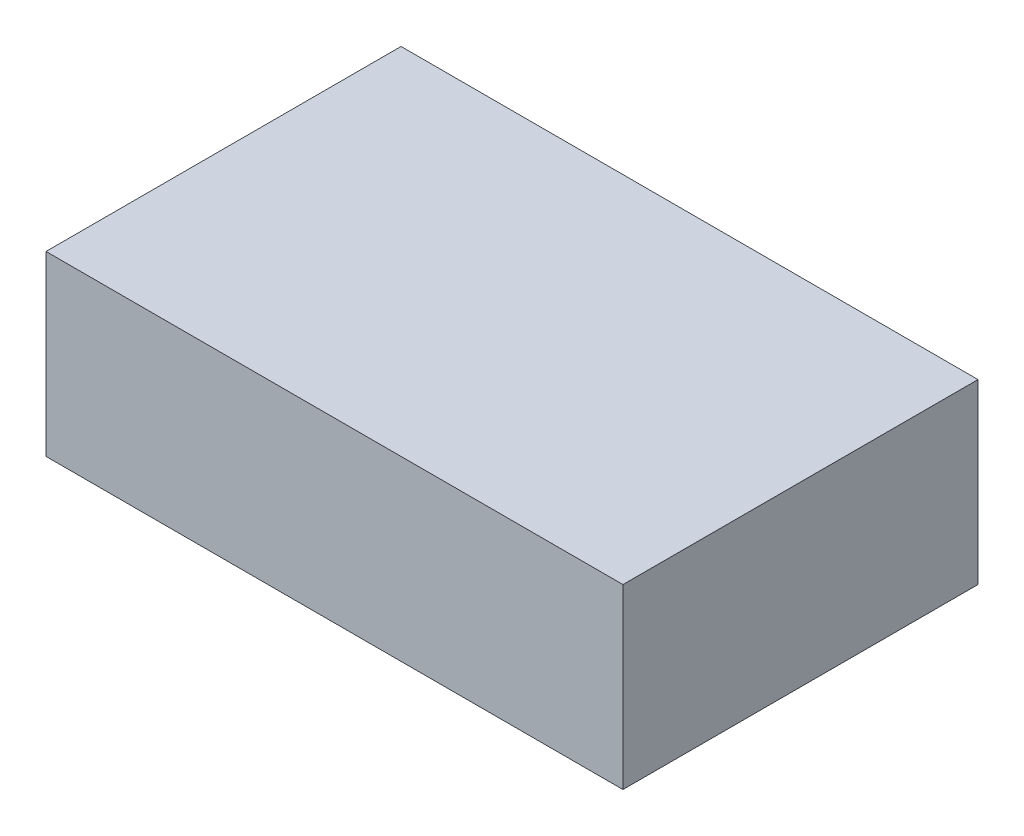
ISO-10303-21;
HEADER;
FILE_DESCRIPTION(('STEP AP214'),'2;1');
FILE_NAME('part.step','',(''),(''),'','','');
FILE_SCHEMA(('AUTOMOTIVE_DESIGN { 1 0 10303 214 1 1 1 1 }'));
ENDSEC;
DATA;
#1=APPLICATION_CONTEXT('core data for automotive mechanical design processes');
#2=APPLICATION_PROTOCOL_DEFINITION('international standard','automotive_design',2000,#1);
#3=PRODUCT_CONTEXT('',#1,'mechanical');
#4=PRODUCT('Part','Part','',(#3));
#5=PRODUCT_RELATED_PRODUCT_CATEGORY('part','',(#4));
#6=PRODUCT_DEFINITION_FORMATION('','',#4);
#7=PRODUCT_DEFINITION_CONTEXT('part definition',#1,'design');
#8=PRODUCT_DEFINITION('design','',#6,#7);
#9=PRODUCT_DEFINITION_SHAPE('','',#8);
#10=(LENGTH_UNIT() NAMED_UNIT(*) SI_UNIT(.MILLI.,.METRE.));
#11=(NAMED_UNIT(*) PLANE_ANGLE_UNIT() SI_UNIT($,.RADIAN.));
#12=(NAMED_UNIT(*) SI_UNIT($,.STERADIAN.) SOLID_ANGLE_UNIT());
#13=UNCERTAINTY_MEASURE_WITH_UNIT(LENGTH_MEASURE(1.E-05),#10,'distance_accuracy_value','');
#14=(GEOMETRIC_REPRESENTATION_CONTEXT(3) GLOBAL_UNCERTAINTY_ASSIGNED_CONTEXT((#13)) GLOBAL_UNIT_ASSIGNED_CONTEXT((#10,
#11,#12)) REPRESENTATION_CONTEXT('',''));
#15=CARTESIAN_POINT('',(0.,0.,0.));
#16=DIRECTION('',(0.,0.,1.));
#17=DIRECTION('',(1.,0.,0.));
#18=AXIS2_PLACEMENT_3D('',#15,#16,#17);
#19=CARTESIAN_POINT('',(65.,40.,40.));
#20=DIRECTION('',(-1.,0.,0.));
#21=DIRECTION('',(0.,0.,1.));
#22=AXIS2_PLACEMENT_3D('',#19,#20,#21);
#23=PLANE('',#22);
#24=DIRECTION('',(0.,0.,-1.));
#25=VECTOR('',#24,1.);
#26=CARTESIAN_POINT('',(65.,0.,40.));
#27=LINE('',#26,#25);
#28=CARTESIAN_POINT('',(65.,0.,40.));
#29=VERTEX_POINT('',#28);
#30=CARTESIAN_POINT('',(65.,0.,-40.));
#31=VERTEX_POINT('',#30);
#32=EDGE_CURVE('E96',#29,#31,#27,.T.);
#33=ORIENTED_EDGE('',*,*,#32,.T.);
#34=DIRECTION('',(0.,-1.,0.));
#35=VECTOR('',#34,1.);
#36=CARTESIAN_POINT('',(65.,40.,-40.));
#37=LINE('',#36,#35);
#38=CARTESIAN_POINT('',(65.,40.,-40.));
#39=VERTEX_POINT('',#38);
#40=EDGE_CURVE('E11',#39,#31,#37,.T.);
#41=ORIENTED_EDGE('',*,*,#40,.F.);
#42=DIRECTION('',(0.,0.,-1.));
#43=VECTOR('',#42,1.);
#44=CARTESIAN_POINT('',(65.,40.,40.));
#45=LINE('',#44,#43);
#46=CARTESIAN_POINT('',(65.,40.,40.));
#47=VERTEX_POINT('',#46);
#48=EDGE_CURVE('E84',#47,#39,#45,.T.);
#49=ORIENTED_EDGE('',*,*,#48,.F.);
#50=DIRECTION('',(0.,-1.,0.));
#51=VECTOR('',#50,1.);
#52=CARTESIAN_POINT('',(65.,40.,40.));
#53=LINE('',#52,#51);
#54=EDGE_CURVE('E92',#47,#29,#53,.T.);
#55=ORIENTED_EDGE('',*,*,#54,.T.);
#56=EDGE_LOOP('',(#33,#41,#49,#55));
#57=FACE_BOUND('',#56,.T.);
#58=ADVANCED_FACE('F33',(#57),#23,.F.);
#59=CARTESIAN_POINT('',(-65.,40.,-40.));
#60=DIRECTION('',(0.,0.,1.));
#61=DIRECTION('',(1.,0.,0.));
#62=AXIS2_PLACEMENT_3D('',#59,#60,#61);
#63=PLANE('',#62);
#64=DIRECTION('',(-1.,0.,0.));
#65=VECTOR('',#64,1.);
#66=CARTESIAN_POINT('',(-65.,0.,-40.));
#67=LINE('',#66,#65);
#68=CARTESIAN_POINT('',(-65.,0.,-40.));
#69=VERTEX_POINT('',#68);
#70=EDGE_CURVE('E88',#31,#69,#67,.T.);
#71=ORIENTED_EDGE('',*,*,#70,.T.);
#72=DIRECTION('',(0.,-1.,0.));
#73=VECTOR('',#72,1.);
#74=CARTESIAN_POINT('',(-65.,40.,-40.));
#75=LINE('',#74,#73);
#76=CARTESIAN_POINT('',(-65.,40.,-40.));
#77=VERTEX_POINT('',#76);
#78=EDGE_CURVE('E41',#77,#69,#75,.T.);
#79=ORIENTED_EDGE('',*,*,#78,.F.);
#80=DIRECTION('',(-1.,0.,0.));
#81=VECTOR('',#80,1.);
#82=CARTESIAN_POINT('',(-65.,40.,-40.));
#83=LINE('',#82,#81);
#84=EDGE_CURVE('E79',#39,#77,#83,.T.);
#85=ORIENTED_EDGE('',*,*,#84,.F.);
#86=ORIENTED_EDGE('',*,*,#40,.T.);
#87=EDGE_LOOP('',(#71,#79,#85,#86));
#88=FACE_BOUND('',#87,.T.);
#89=ADVANCED_FACE('F87',(#88),#63,.F.);
#90=CARTESIAN_POINT('',(-65.,40.,40.));
#91=DIRECTION('',(1.,0.,0.));
#92=DIRECTION('',(0.,0.,-1.));
#93=AXIS2_PLACEMENT_3D('',#90,#91,#92);
#94=PLANE('',#93);
#95=DIRECTION('',(0.,0.,1.));
#96=VECTOR('',#95,1.);
#97=CARTESIAN_POINT('',(-65.,0.,40.));
#98=LINE('',#97,#96);
#99=CARTESIAN_POINT('',(-65.,0.,40.));
#100=VERTEX_POINT('',#99);
#101=EDGE_CURVE('E66',#69,#100,#98,.T.);
#102=ORIENTED_EDGE('',*,*,#101,.T.);
#103=DIRECTION('',(0.,-1.,0.));
#104=VECTOR('',#103,1.);
#105=CARTESIAN_POINT('',(-65.,40.,40.));
#106=LINE('',#105,#104);
#107=CARTESIAN_POINT('',(-65.,40.,40.));
#108=VERTEX_POINT('',#107);
#109=EDGE_CURVE('E89',#108,#100,#106,.T.);
#110=ORIENTED_EDGE('',*,*,#109,.F.);
#111=DIRECTION('',(0.,0.,1.));
#112=VECTOR('',#111,1.);
#113=CARTESIAN_POINT('',(-65.,40.,40.));
#114=LINE('',#113,#112);
#115=EDGE_CURVE('E82',#77,#108,#114,.T.);
#116=ORIENTED_EDGE('',*,*,#115,.F.);
#117=ORIENTED_EDGE('',*,*,#78,.T.);
#118=EDGE_LOOP('',(#102,#110,#116,#117));
#119=FACE_BOUND('',#118,.T.);
#120=ADVANCED_FACE('F90',(#119),#94,.F.);
#121=CARTESIAN_POINT('',(-65.,40.,40.));
#122=DIRECTION('',(0.,0.,-1.));
#123=DIRECTION('',(-1.,0.,0.));
#124=AXIS2_PLACEMENT_3D('',#121,#122,#123);
#125=PLANE('',#124);
#126=DIRECTION('',(1.,0.,0.));
#127=VECTOR('',#126,1.);
#128=CARTESIAN_POINT('',(-65.,0.,40.));
#129=LINE('',#128,#127);
#130=EDGE_CURVE('E72',#100,#29,#129,.T.);
#131=ORIENTED_EDGE('',*,*,#130,.T.);
#132=ORIENTED_EDGE('',*,*,#54,.F.);
#133=DIRECTION('',(1.,0.,0.));
#134=VECTOR('',#133,1.);
#135=CARTESIAN_POINT('',(-65.,40.,40.));
#136=LINE('',#135,#134);
#137=EDGE_CURVE('E49',#108,#47,#136,.T.);
#138=ORIENTED_EDGE('',*,*,#137,.F.);
#139=ORIENTED_EDGE('',*,*,#109,.T.);
#140=EDGE_LOOP('',(#131,#132,#138,#139));
#141=FACE_BOUND('',#140,.T.);
#142=ADVANCED_FACE('F103',(#141),#125,.F.);
#143=CARTESIAN_POINT('',(0.,40.,0.));
#144=DIRECTION('',(0.,-1.,0.));
#145=DIRECTION('',(0.,0.,-1.));
#146=AXIS2_PLACEMENT_3D('',#143,#144,#145);
#147=PLANE('',#146);
#148=ORIENTED_EDGE('',*,*,#48,.T.);
#149=ORIENTED_EDGE('',*,*,#84,.T.);
#150=ORIENTED_EDGE('',*,*,#115,.T.);
#151=ORIENTED_EDGE('',*,*,#137,.T.);
#152=EDGE_LOOP('',(#148,#149,#150,#151));
#153=FACE_BOUND('',#152,.T.);
#154=ADVANCED_FACE('F80',(#153),#147,.F.);
#155=CARTESIAN_POINT('',(0.,0.,0.));
#156=DIRECTION('',(0.,-1.,0.));
#157=DIRECTION('',(0.,0.,-1.));
#158=AXIS2_PLACEMENT_3D('',#155,#156,#157);
#159=PLANE('',#158);
#160=ORIENTED_EDGE('',*,*,#32,.F.);
#161=ORIENTED_EDGE('',*,*,#130,.F.);
#162=ORIENTED_EDGE('',*,*,#101,.F.);
#163=ORIENTED_EDGE('',*,*,#70,.F.);
#164=EDGE_LOOP('',(#160,#161,#162,#163));
#165=FACE_BOUND('',#164,.T.);
#166=ADVANCED_FACE('F106',(#165),#159,.T.);
#167=CLOSED_SHELL('',(#58,#89,#120,#142,#154,#166));
#168=MANIFOLD_SOLID_BREP('B2',#167);
#169=ADVANCED_BREP_SHAPE_REPRESENTATION('',(#18,#168),#14);
#170=SHAPE_DEFINITION_REPRESENTATION(#9,#169);
ENDSEC;
END-ISO-10303-21;
